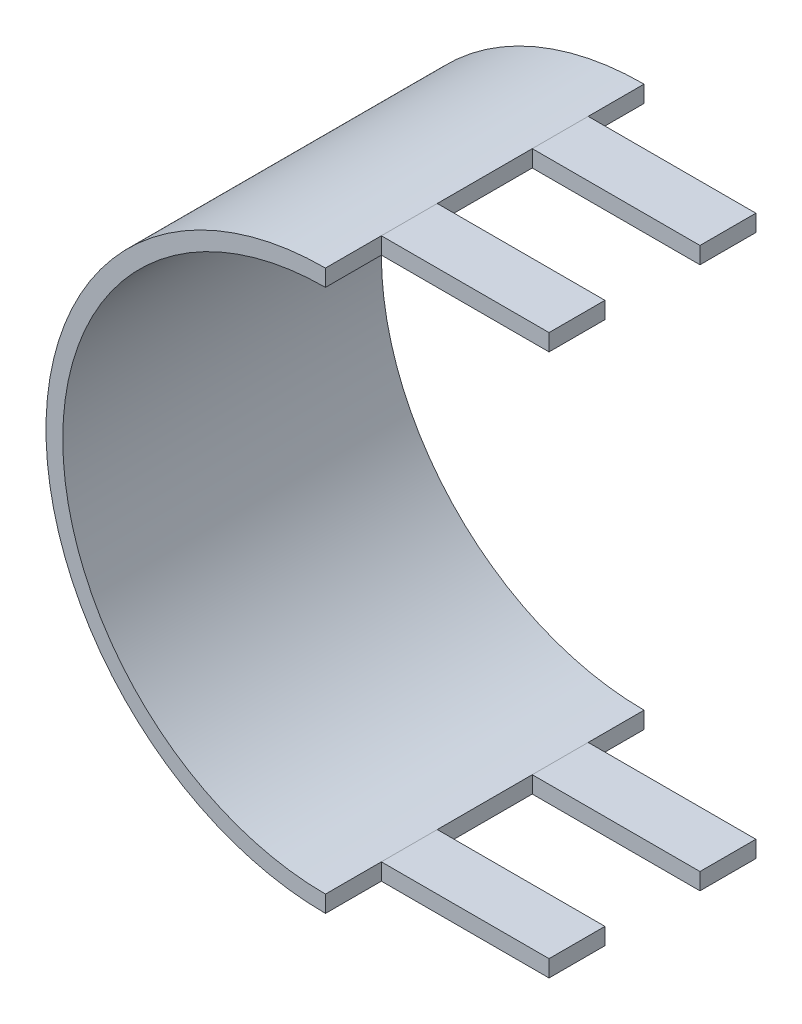
ISO-10303-21;
HEADER;
FILE_DESCRIPTION(('STEP AP214'),'2;1');
FILE_NAME('part.step','',(''),(''),'','','');
FILE_SCHEMA(('AUTOMOTIVE_DESIGN { 1 0 10303 214 1 1 1 1 }'));
ENDSEC;
DATA;
#1=APPLICATION_CONTEXT('core data for automotive mechanical design processes');
#2=APPLICATION_PROTOCOL_DEFINITION('international standard','automotive_design',2000,#1);
#3=PRODUCT_CONTEXT('',#1,'mechanical');
#4=PRODUCT('Part','Part','',(#3));
#5=PRODUCT_RELATED_PRODUCT_CATEGORY('part','',(#4));
#6=PRODUCT_DEFINITION_FORMATION('','',#4);
#7=PRODUCT_DEFINITION_CONTEXT('part definition',#1,'design');
#8=PRODUCT_DEFINITION('design','',#6,#7);
#9=PRODUCT_DEFINITION_SHAPE('','',#8);
#10=(LENGTH_UNIT() NAMED_UNIT(*) SI_UNIT(.MILLI.,.METRE.));
#11=(NAMED_UNIT(*) PLANE_ANGLE_UNIT() SI_UNIT($,.RADIAN.));
#12=(NAMED_UNIT(*) SI_UNIT($,.STERADIAN.) SOLID_ANGLE_UNIT());
#13=UNCERTAINTY_MEASURE_WITH_UNIT(LENGTH_MEASURE(1.E-05),#10,'distance_accuracy_value','');
#14=(GEOMETRIC_REPRESENTATION_CONTEXT(3) GLOBAL_UNCERTAINTY_ASSIGNED_CONTEXT((#13)) GLOBAL_UNIT_ASSIGNED_CONTEXT((#10,
#11,#12)) REPRESENTATION_CONTEXT('',''));
#15=CARTESIAN_POINT('',(0.,0.,0.));
#16=DIRECTION('',(0.,0.,1.));
#17=DIRECTION('',(1.,0.,0.));
#18=AXIS2_PLACEMENT_3D('',#15,#16,#17);
#19=CARTESIAN_POINT('',(-300.,-47.,3.));
#20=DIRECTION('',(0.,-1.,0.));
#21=DIRECTION('',(0.,0.,-1.));
#22=AXIS2_PLACEMENT_3D('',#19,#20,#21);
#23=PLANE('',#22);
#24=DIRECTION('',(-1.,0.,0.));
#25=VECTOR('',#24,1.);
#26=CARTESIAN_POINT('',(-300.,-47.,23.));
#27=LINE('',#26,#25);
#28=CARTESIAN_POINT('',(-270.,-47.,23.));
#29=VERTEX_POINT('',#28);
#30=CARTESIAN_POINT('',(-300.,-47.,23.));
#31=VERTEX_POINT('',#30);
#32=EDGE_CURVE('E205',#29,#31,#27,.T.);
#33=ORIENTED_EDGE('',*,*,#32,.F.);
#34=DIRECTION('',(0.,0.,1.));
#35=VECTOR('',#34,1.);
#36=CARTESIAN_POINT('',(-270.,-47.,3.));
#37=LINE('',#36,#35);
#38=CARTESIAN_POINT('',(-270.,-47.,13.));
#39=VERTEX_POINT('',#38);
#40=EDGE_CURVE('E177',#39,#29,#37,.T.);
#41=ORIENTED_EDGE('',*,*,#40,.F.);
#42=DIRECTION('',(1.,0.,0.));
#43=VECTOR('',#42,1.);
#44=CARTESIAN_POINT('',(-300.,-47.,13.));
#45=LINE('',#44,#43);
#46=CARTESIAN_POINT('',(-300.,-47.,13.));
#47=VERTEX_POINT('',#46);
#48=EDGE_CURVE('E208',#47,#39,#45,.T.);
#49=ORIENTED_EDGE('',*,*,#48,.F.);
#50=DIRECTION('',(0.,0.,1.));
#51=VECTOR('',#50,1.);
#52=CARTESIAN_POINT('',(-300.,-47.,3.));
#53=LINE('',#52,#51);
#54=EDGE_CURVE('E182',#47,#31,#53,.T.);
#55=ORIENTED_EDGE('',*,*,#54,.T.);
#56=EDGE_LOOP('',(#33,#41,#49,#55));
#57=FACE_BOUND('',#56,.T.);
#58=ADVANCED_FACE('F32',(#57),#23,.F.);
#59=CARTESIAN_POINT('',(-300.,-47.,3.));
#60=DIRECTION('',(0.,-1.,0.));
#61=DIRECTION('',(0.,0.,-1.));
#62=AXIS2_PLACEMENT_3D('',#59,#60,#61);
#63=PLANE('',#62);
#64=DIRECTION('',(-1.,0.,0.));
#65=VECTOR('',#64,1.);
#66=CARTESIAN_POINT('',(-300.,-47.,50.));
#67=LINE('',#66,#65);
#68=CARTESIAN_POINT('',(-270.,-47.,50.));
#69=VERTEX_POINT('',#68);
#70=CARTESIAN_POINT('',(-300.,-47.,50.));
#71=VERTEX_POINT('',#70);
#72=EDGE_CURVE('E278',#69,#71,#67,.T.);
#73=ORIENTED_EDGE('',*,*,#72,.F.);
#74=DIRECTION('',(0.,0.,1.));
#75=VECTOR('',#74,1.);
#76=CARTESIAN_POINT('',(-270.,-47.,3.));
#77=LINE('',#76,#75);
#78=CARTESIAN_POINT('',(-270.,-47.,40.));
#79=VERTEX_POINT('',#78);
#80=EDGE_CURVE('E280',#79,#69,#77,.T.);
#81=ORIENTED_EDGE('',*,*,#80,.F.);
#82=DIRECTION('',(1.,0.,0.));
#83=VECTOR('',#82,1.);
#84=CARTESIAN_POINT('',(-300.,-47.,40.));
#85=LINE('',#84,#83);
#86=CARTESIAN_POINT('',(-300.,-47.,40.));
#87=VERTEX_POINT('',#86);
#88=EDGE_CURVE('E251',#87,#79,#85,.T.);
#89=ORIENTED_EDGE('',*,*,#88,.F.);
#90=DIRECTION('',(0.,0.,1.));
#91=VECTOR('',#90,1.);
#92=CARTESIAN_POINT('',(-300.,-47.,3.));
#93=LINE('',#92,#91);
#94=EDGE_CURVE('E258',#87,#71,#93,.T.);
#95=ORIENTED_EDGE('',*,*,#94,.T.);
#96=EDGE_LOOP('',(#73,#81,#89,#95));
#97=FACE_BOUND('',#96,.T.);
#98=ADVANCED_FACE('F403',(#97),#63,.F.);
#99=CARTESIAN_POINT('',(300.,47.,3.));
#100=DIRECTION('',(0.,1.,0.));
#101=DIRECTION('',(0.,0.,1.));
#102=AXIS2_PLACEMENT_3D('',#99,#100,#101);
#103=PLANE('',#102);
#104=DIRECTION('',(1.,0.,0.));
#105=VECTOR('',#104,1.);
#106=CARTESIAN_POINT('',(300.,47.,50.));
#107=LINE('',#106,#105);
#108=CARTESIAN_POINT('',(-300.,47.,50.));
#109=VERTEX_POINT('',#108);
#110=CARTESIAN_POINT('',(-270.,47.,50.));
#111=VERTEX_POINT('',#110);
#112=EDGE_CURVE('E329',#109,#111,#107,.T.);
#113=ORIENTED_EDGE('',*,*,#112,.F.);
#114=DIRECTION('',(0.,0.,1.));
#115=VECTOR('',#114,1.);
#116=CARTESIAN_POINT('',(-300.,47.,3.));
#117=LINE('',#116,#115);
#118=CARTESIAN_POINT('',(-300.,47.,39.9999999999999));
#119=VERTEX_POINT('',#118);
#120=EDGE_CURVE('E321',#119,#109,#117,.T.);
#121=ORIENTED_EDGE('',*,*,#120,.F.);
#122=DIRECTION('',(-1.,0.,0.));
#123=VECTOR('',#122,1.);
#124=CARTESIAN_POINT('',(300.,47.,40.));
#125=LINE('',#124,#123);
#126=CARTESIAN_POINT('',(-270.,47.,40.));
#127=VERTEX_POINT('',#126);
#128=EDGE_CURVE('E334',#127,#119,#125,.T.);
#129=ORIENTED_EDGE('',*,*,#128,.F.);
#130=DIRECTION('',(0.,0.,-1.));
#131=VECTOR('',#130,1.);
#132=CARTESIAN_POINT('',(-270.,47.,3.));
#133=LINE('',#132,#131);
#134=EDGE_CURVE('E36',#111,#127,#133,.T.);
#135=ORIENTED_EDGE('',*,*,#134,.F.);
#136=EDGE_LOOP('',(#113,#121,#129,#135));
#137=FACE_BOUND('',#136,.T.);
#138=ADVANCED_FACE('F342',(#137),#103,.F.);
#139=CARTESIAN_POINT('',(300.,47.,3.));
#140=DIRECTION('',(0.,1.,0.));
#141=DIRECTION('',(0.,0.,1.));
#142=AXIS2_PLACEMENT_3D('',#139,#140,#141);
#143=PLANE('',#142);
#144=DIRECTION('',(1.,0.,0.));
#145=VECTOR('',#144,1.);
#146=CARTESIAN_POINT('',(300.,47.,22.9999999999999));
#147=LINE('',#146,#145);
#148=CARTESIAN_POINT('',(-300.,47.,23.));
#149=VERTEX_POINT('',#148);
#150=CARTESIAN_POINT('',(-270.,47.,23.));
#151=VERTEX_POINT('',#150);
#152=EDGE_CURVE('E307',#149,#151,#147,.T.);
#153=ORIENTED_EDGE('',*,*,#152,.F.);
#154=DIRECTION('',(0.,0.,1.));
#155=VECTOR('',#154,1.);
#156=CARTESIAN_POINT('',(-300.,47.,3.));
#157=LINE('',#156,#155);
#158=CARTESIAN_POINT('',(-300.,47.,13.));
#159=VERTEX_POINT('',#158);
#160=EDGE_CURVE('E289',#159,#149,#157,.T.);
#161=ORIENTED_EDGE('',*,*,#160,.F.);
#162=DIRECTION('',(-1.,0.,0.));
#163=VECTOR('',#162,1.);
#164=CARTESIAN_POINT('',(300.,47.,13.));
#165=LINE('',#164,#163);
#166=CARTESIAN_POINT('',(-270.,47.,13.));
#167=VERTEX_POINT('',#166);
#168=EDGE_CURVE('E301',#167,#159,#165,.T.);
#169=ORIENTED_EDGE('',*,*,#168,.F.);
#170=DIRECTION('',(0.,0.,-1.));
#171=VECTOR('',#170,1.);
#172=CARTESIAN_POINT('',(-270.,47.,3.));
#173=LINE('',#172,#171);
#174=EDGE_CURVE('E304',#151,#167,#173,.T.);
#175=ORIENTED_EDGE('',*,*,#174,.F.);
#176=EDGE_LOOP('',(#153,#161,#169,#175));
#177=FACE_BOUND('',#176,.T.);
#178=ADVANCED_FACE('F425',(#177),#143,.F.);
#179=CARTESIAN_POINT('',(-300.,46.99,13.));
#180=DIRECTION('',(0.,0.,-1.));
#181=DIRECTION('',(-1.,0.,0.));
#182=AXIS2_PLACEMENT_3D('',#179,#180,#181);
#183=PLANE('',#182);
#184=DIRECTION('',(0.,1.,0.));
#185=VECTOR('',#184,1.);
#186=CARTESIAN_POINT('',(-270.,46.99,13.));
#187=LINE('',#186,#185);
#188=CARTESIAN_POINT('',(-270.,50.,13.));
#189=VERTEX_POINT('',#188);
#190=EDGE_CURVE('E316',#167,#189,#187,.T.);
#191=ORIENTED_EDGE('',*,*,#190,.F.);
#192=ORIENTED_EDGE('',*,*,#168,.T.);
#193=DIRECTION('',(0.,-1.,0.));
#194=VECTOR('',#193,1.);
#195=CARTESIAN_POINT('',(-300.,0.,13.));
#196=LINE('',#195,#194);
#197=CARTESIAN_POINT('',(-300.,50.,13.));
#198=VERTEX_POINT('',#197);
#199=EDGE_CURVE('E292',#198,#159,#196,.T.);
#200=ORIENTED_EDGE('',*,*,#199,.F.);
#201=DIRECTION('',(1.,0.,0.));
#202=VECTOR('',#201,1.);
#203=CARTESIAN_POINT('',(-300.,50.,13.));
#204=LINE('',#203,#202);
#205=EDGE_CURVE('E255',#198,#189,#204,.T.);
#206=ORIENTED_EDGE('',*,*,#205,.T.);
#207=EDGE_LOOP('',(#191,#192,#200,#206));
#208=FACE_BOUND('',#207,.T.);
#209=ADVANCED_FACE('F413',(#208),#183,.T.);
#210=CARTESIAN_POINT('',(-300.,0.,0.));
#211=DIRECTION('',(-1.,0.,0.));
#212=DIRECTION('',(0.,0.,1.));
#213=AXIS2_PLACEMENT_3D('',#210,#211,#212);
#214=PLANE('',#213);
#215=DIRECTION('',(0.,0.,-1.));
#216=VECTOR('',#215,1.);
#217=CARTESIAN_POINT('',(-300.,50.,60.));
#218=LINE('',#217,#216);
#219=CARTESIAN_POINT('',(-300.,50.,3.));
#220=VERTEX_POINT('',#219);
#221=EDGE_CURVE('E235',#198,#220,#218,.T.);
#222=ORIENTED_EDGE('',*,*,#221,.F.);
#223=ORIENTED_EDGE('',*,*,#199,.T.);
#224=DIRECTION('',(0.,0.,1.));
#225=VECTOR('',#224,1.);
#226=CARTESIAN_POINT('',(-300.,47.,3.));
#227=LINE('',#226,#225);
#228=CARTESIAN_POINT('',(-300.,47.,3.));
#229=VERTEX_POINT('',#228);
#230=EDGE_CURVE('E220',#229,#159,#227,.T.);
#231=ORIENTED_EDGE('',*,*,#230,.F.);
#232=DIRECTION('',(0.,1.,0.));
#233=VECTOR('',#232,1.);
#234=CARTESIAN_POINT('',(-300.,0.,3.));
#235=LINE('',#234,#233);
#236=EDGE_CURVE('E248',#229,#220,#235,.T.);
#237=ORIENTED_EDGE('',*,*,#236,.T.);
#238=EDGE_LOOP('',(#222,#223,#231,#237));
#239=FACE_BOUND('',#238,.T.);
#240=ADVANCED_FACE('F410',(#239),#214,.F.);
#241=CARTESIAN_POINT('',(-270.,-50.01,40.));
#242=DIRECTION('',(1.,0.,0.));
#243=DIRECTION('',(0.,0.,-1.));
#244=AXIS2_PLACEMENT_3D('',#241,#242,#243);
#245=PLANE('',#244);
#246=DIRECTION('',(0.,1.,0.));
#247=VECTOR('',#246,1.);
#248=CARTESIAN_POINT('',(-270.,-50.01,50.));
#249=LINE('',#248,#247);
#250=CARTESIAN_POINT('',(-270.,-50.,50.));
#251=VERTEX_POINT('',#250);
#252=EDGE_CURVE('E256',#251,#69,#249,.T.);
#253=ORIENTED_EDGE('',*,*,#252,.F.);
#254=DIRECTION('',(0.,0.,-1.));
#255=VECTOR('',#254,1.);
#256=CARTESIAN_POINT('',(-270.,-50.,60.));
#257=LINE('',#256,#255);
#258=CARTESIAN_POINT('',(-270.,-50.,40.));
#259=VERTEX_POINT('',#258);
#260=EDGE_CURVE('E272',#251,#259,#257,.T.);
#261=ORIENTED_EDGE('',*,*,#260,.T.);
#262=DIRECTION('',(0.,1.,0.));
#263=VECTOR('',#262,1.);
#264=CARTESIAN_POINT('',(-270.,-50.01,40.));
#265=LINE('',#264,#263);
#266=EDGE_CURVE('E253',#259,#79,#265,.T.);
#267=ORIENTED_EDGE('',*,*,#266,.T.);
#268=ORIENTED_EDGE('',*,*,#80,.T.);
#269=EDGE_LOOP('',(#253,#261,#267,#268));
#270=FACE_BOUND('',#269,.T.);
#271=ADVANCED_FACE('F398',(#270),#245,.T.);
#272=CARTESIAN_POINT('',(-300.,-50.01,40.));
#273=DIRECTION('',(0.,0.,-1.));
#274=DIRECTION('',(-1.,0.,0.));
#275=AXIS2_PLACEMENT_3D('',#272,#273,#274);
#276=PLANE('',#275);
#277=ORIENTED_EDGE('',*,*,#266,.F.);
#278=DIRECTION('',(-1.,0.,0.));
#279=VECTOR('',#278,1.);
#280=CARTESIAN_POINT('',(-300.,-50.,40.));
#281=LINE('',#280,#279);
#282=CARTESIAN_POINT('',(-300.,-50.,40.));
#283=VERTEX_POINT('',#282);
#284=EDGE_CURVE('E275',#259,#283,#281,.T.);
#285=ORIENTED_EDGE('',*,*,#284,.T.);
#286=DIRECTION('',(0.,-1.,0.));
#287=VECTOR('',#286,1.);
#288=CARTESIAN_POINT('',(-300.,0.,40.));
#289=LINE('',#288,#287);
#290=EDGE_CURVE('E262',#87,#283,#289,.T.);
#291=ORIENTED_EDGE('',*,*,#290,.F.);
#292=ORIENTED_EDGE('',*,*,#88,.T.);
#293=EDGE_LOOP('',(#277,#285,#291,#292));
#294=FACE_BOUND('',#293,.T.);
#295=ADVANCED_FACE('F394',(#294),#276,.T.);
#296=CARTESIAN_POINT('',(-300.,-50.01,50.));
#297=DIRECTION('',(0.,0.,1.));
#298=DIRECTION('',(1.,0.,0.));
#299=AXIS2_PLACEMENT_3D('',#296,#297,#298);
#300=PLANE('',#299);
#301=DIRECTION('',(0.,1.,0.));
#302=VECTOR('',#301,1.);
#303=CARTESIAN_POINT('',(-300.,0.,50.));
#304=LINE('',#303,#302);
#305=CARTESIAN_POINT('',(-300.,-50.,50.));
#306=VERTEX_POINT('',#305);
#307=EDGE_CURVE('E259',#306,#71,#304,.T.);
#308=ORIENTED_EDGE('',*,*,#307,.F.);
#309=DIRECTION('',(1.,0.,0.));
#310=VECTOR('',#309,1.);
#311=CARTESIAN_POINT('',(-300.,-50.,50.));
#312=LINE('',#311,#310);
#313=EDGE_CURVE('E263',#306,#251,#312,.T.);
#314=ORIENTED_EDGE('',*,*,#313,.T.);
#315=ORIENTED_EDGE('',*,*,#252,.T.);
#316=ORIENTED_EDGE('',*,*,#72,.T.);
#317=EDGE_LOOP('',(#308,#314,#315,#316));
#318=FACE_BOUND('',#317,.T.);
#319=ADVANCED_FACE('F401',(#318),#300,.T.);
#320=CARTESIAN_POINT('',(0.,0.,3.));
#321=DIRECTION('',(0.,0.,1.));
#322=DIRECTION('',(1.,0.,0.));
#323=AXIS2_PLACEMENT_3D('',#320,#321,#322);
#324=PLANE('',#323);
#325=DIRECTION('',(0.,1.,0.));
#326=VECTOR('',#325,1.);
#327=CARTESIAN_POINT('',(-300.,0.,3.));
#328=LINE('',#327,#326);
#329=CARTESIAN_POINT('',(-300.,-50.,3.));
#330=VERTEX_POINT('',#329);
#331=CARTESIAN_POINT('',(-300.,-47.,3.));
#332=VERTEX_POINT('',#331);
#333=EDGE_CURVE('E245',#330,#332,#328,.T.);
#334=ORIENTED_EDGE('',*,*,#333,.F.);
#335=CARTESIAN_POINT('',(-300.,0.,3.));
#336=DIRECTION('',(0.,0.,1.));
#337=DIRECTION('',(1.,0.,0.));
#338=AXIS2_PLACEMENT_3D('',#335,#336,#337);
#339=CIRCLE('',#338,50.);
#340=EDGE_CURVE('E219',#220,#330,#339,.T.);
#341=ORIENTED_EDGE('',*,*,#340,.F.);
#342=ORIENTED_EDGE('',*,*,#236,.F.);
#343=CARTESIAN_POINT('',(-300.,0.,3.));
#344=DIRECTION('',(0.,0.,1.));
#345=DIRECTION('',(1.,0.,0.));
#346=AXIS2_PLACEMENT_3D('',#343,#344,#345);
#347=CIRCLE('',#346,47.);
#348=EDGE_CURVE('E244',#332,#229,#347,.F.);
#349=ORIENTED_EDGE('',*,*,#348,.F.);
#350=EDGE_LOOP('',(#334,#341,#342,#349));
#351=FACE_BOUND('',#350,.T.);
#352=ADVANCED_FACE('F407',(#351),#324,.F.);
#353=CARTESIAN_POINT('',(-270.,-50.01,13.));
#354=DIRECTION('',(1.,0.,0.));
#355=DIRECTION('',(0.,0.,-1.));
#356=AXIS2_PLACEMENT_3D('',#353,#354,#355);
#357=PLANE('',#356);
#358=DIRECTION('',(0.,1.,0.));
#359=VECTOR('',#358,1.);
#360=CARTESIAN_POINT('',(-270.,-50.01,23.));
#361=LINE('',#360,#359);
#362=CARTESIAN_POINT('',(-270.,-50.,23.));
#363=VERTEX_POINT('',#362);
#364=EDGE_CURVE('E172',#363,#29,#361,.T.);
#365=ORIENTED_EDGE('',*,*,#364,.F.);
#366=DIRECTION('',(0.,0.,-1.));
#367=VECTOR('',#366,1.);
#368=CARTESIAN_POINT('',(-270.,-50.,60.));
#369=LINE('',#368,#367);
#370=CARTESIAN_POINT('',(-270.,-50.,13.));
#371=VERTEX_POINT('',#370);
#372=EDGE_CURVE('E175',#363,#371,#369,.T.);
#373=ORIENTED_EDGE('',*,*,#372,.T.);
#374=DIRECTION('',(0.,1.,0.));
#375=VECTOR('',#374,1.);
#376=CARTESIAN_POINT('',(-270.,-50.01,13.));
#377=LINE('',#376,#375);
#378=EDGE_CURVE('E181',#371,#39,#377,.T.);
#379=ORIENTED_EDGE('',*,*,#378,.T.);
#380=ORIENTED_EDGE('',*,*,#40,.T.);
#381=EDGE_LOOP('',(#365,#373,#379,#380));
#382=FACE_BOUND('',#381,.T.);
#383=ADVANCED_FACE('F174',(#382),#357,.T.);
#384=CARTESIAN_POINT('',(-300.,-50.01,13.));
#385=DIRECTION('',(0.,0.,-1.));
#386=DIRECTION('',(-1.,0.,0.));
#387=AXIS2_PLACEMENT_3D('',#384,#385,#386);
#388=PLANE('',#387);
#389=ORIENTED_EDGE('',*,*,#378,.F.);
#390=DIRECTION('',(-1.,0.,0.));
#391=VECTOR('',#390,1.);
#392=CARTESIAN_POINT('',(-300.,-50.,13.));
#393=LINE('',#392,#391);
#394=CARTESIAN_POINT('',(-300.,-50.,13.));
#395=VERTEX_POINT('',#394);
#396=EDGE_CURVE('E191',#371,#395,#393,.T.);
#397=ORIENTED_EDGE('',*,*,#396,.T.);
#398=DIRECTION('',(0.,-1.,0.));
#399=VECTOR('',#398,1.);
#400=CARTESIAN_POINT('',(-300.,0.,13.));
#401=LINE('',#400,#399);
#402=EDGE_CURVE('E198',#47,#395,#401,.T.);
#403=ORIENTED_EDGE('',*,*,#402,.F.);
#404=ORIENTED_EDGE('',*,*,#48,.T.);
#405=EDGE_LOOP('',(#389,#397,#403,#404));
#406=FACE_BOUND('',#405,.T.);
#407=ADVANCED_FACE('F378',(#406),#388,.T.);
#408=CARTESIAN_POINT('',(-300.,-50.01,23.));
#409=DIRECTION('',(0.,0.,1.));
#410=DIRECTION('',(1.,0.,0.));
#411=AXIS2_PLACEMENT_3D('',#408,#409,#410);
#412=PLANE('',#411);
#413=DIRECTION('',(0.,1.,0.));
#414=VECTOR('',#413,1.);
#415=CARTESIAN_POINT('',(-300.,0.,23.));
#416=LINE('',#415,#414);
#417=CARTESIAN_POINT('',(-300.,-50.,23.));
#418=VERTEX_POINT('',#417);
#419=EDGE_CURVE('E196',#418,#31,#416,.T.);
#420=ORIENTED_EDGE('',*,*,#419,.F.);
#421=DIRECTION('',(1.,0.,0.));
#422=VECTOR('',#421,1.);
#423=CARTESIAN_POINT('',(-300.,-50.,23.));
#424=LINE('',#423,#422);
#425=EDGE_CURVE('E188',#418,#363,#424,.T.);
#426=ORIENTED_EDGE('',*,*,#425,.T.);
#427=ORIENTED_EDGE('',*,*,#364,.T.);
#428=ORIENTED_EDGE('',*,*,#32,.T.);
#429=EDGE_LOOP('',(#420,#426,#427,#428));
#430=FACE_BOUND('',#429,.T.);
#431=ADVANCED_FACE('F194',(#430),#412,.T.);
#432=CARTESIAN_POINT('',(-300.,-50.,60.));
#433=DIRECTION('',(0.,1.,0.));
#434=DIRECTION('',(0.,0.,1.));
#435=AXIS2_PLACEMENT_3D('',#432,#433,#434);
#436=PLANE('',#435);
#437=ORIENTED_EDGE('',*,*,#425,.F.);
#438=DIRECTION('',(0.,0.,-1.));
#439=VECTOR('',#438,1.);
#440=CARTESIAN_POINT('',(-300.,-50.,60.));
#441=LINE('',#440,#439);
#442=EDGE_CURVE('E201',#418,#395,#441,.T.);
#443=ORIENTED_EDGE('',*,*,#442,.T.);
#444=ORIENTED_EDGE('',*,*,#396,.F.);
#445=ORIENTED_EDGE('',*,*,#372,.F.);
#446=EDGE_LOOP('',(#437,#443,#444,#445));
#447=FACE_BOUND('',#446,.T.);
#448=ADVANCED_FACE('F187',(#447),#436,.F.);
#449=DIRECTION('',(0.,0.,1.));
#450=VECTOR('',#449,1.);
#451=CARTESIAN_POINT('',(-300.,-47.,3.));
#452=LINE('',#451,#450);
#453=EDGE_CURVE('E227',#332,#47,#452,.T.);
#454=ORIENTED_EDGE('',*,*,#453,.T.);
#455=ORIENTED_EDGE('',*,*,#402,.T.);
#456=DIRECTION('',(0.,0.,-1.));
#457=VECTOR('',#456,1.);
#458=CARTESIAN_POINT('',(-300.,-50.,60.));
#459=LINE('',#458,#457);
#460=EDGE_CURVE('E226',#395,#330,#459,.T.);
#461=ORIENTED_EDGE('',*,*,#460,.T.);
#462=ORIENTED_EDGE('',*,*,#333,.T.);
#463=EDGE_LOOP('',(#454,#455,#461,#462));
#464=FACE_BOUND('',#463,.T.);
#465=ADVANCED_FACE('F380',(#464),#214,.F.);
#466=CARTESIAN_POINT('',(-300.,-50.,60.));
#467=VERTEX_POINT('',#466);
#468=EDGE_CURVE('E221',#467,#306,#459,.T.);
#469=ORIENTED_EDGE('',*,*,#468,.T.);
#470=ORIENTED_EDGE('',*,*,#307,.T.);
#471=CARTESIAN_POINT('',(-300.,-47.,60.));
#472=VERTEX_POINT('',#471);
#473=EDGE_CURVE('E231',#71,#472,#452,.T.);
#474=ORIENTED_EDGE('',*,*,#473,.T.);
#475=DIRECTION('',(0.,-1.,0.));
#476=VECTOR('',#475,1.);
#477=CARTESIAN_POINT('',(-300.,0.,60.));
#478=LINE('',#477,#476);
#479=EDGE_CURVE('E224',#472,#467,#478,.T.);
#480=ORIENTED_EDGE('',*,*,#479,.T.);
#481=EDGE_LOOP('',(#469,#470,#474,#480));
#482=FACE_BOUND('',#481,.T.);
#483=ADVANCED_FACE('F364',(#482),#214,.F.);
#484=CARTESIAN_POINT('',(-300.,47.,60.));
#485=VERTEX_POINT('',#484);
#486=EDGE_CURVE('E214',#109,#485,#227,.T.);
#487=ORIENTED_EDGE('',*,*,#486,.F.);
#488=DIRECTION('',(0.,1.,0.));
#489=VECTOR('',#488,1.);
#490=CARTESIAN_POINT('',(-300.,0.,50.));
#491=LINE('',#490,#489);
#492=CARTESIAN_POINT('',(-300.,50.,50.));
#493=VERTEX_POINT('',#492);
#494=EDGE_CURVE('E327',#109,#493,#491,.T.);
#495=ORIENTED_EDGE('',*,*,#494,.T.);
#496=CARTESIAN_POINT('',(-300.,50.,60.));
#497=VERTEX_POINT('',#496);
#498=EDGE_CURVE('E215',#497,#493,#218,.T.);
#499=ORIENTED_EDGE('',*,*,#498,.F.);
#500=EDGE_CURVE('E232',#497,#485,#478,.T.);
#501=ORIENTED_EDGE('',*,*,#500,.T.);
#502=EDGE_LOOP('',(#487,#495,#499,#501));
#503=FACE_BOUND('',#502,.T.);
#504=ADVANCED_FACE('F357',(#503),#214,.F.);
#505=CARTESIAN_POINT('',(-300.,0.,60.));
#506=DIRECTION('',(0.,0.,1.));
#507=DIRECTION('',(1.,0.,0.));
#508=AXIS2_PLACEMENT_3D('',#505,#506,#507);
#509=PLANE('',#508);
#510=ORIENTED_EDGE('',*,*,#500,.F.);
#511=CARTESIAN_POINT('',(-300.,0.,60.));
#512=DIRECTION('',(0.,0.,1.));
#513=DIRECTION('',(1.,0.,0.));
#514=AXIS2_PLACEMENT_3D('',#511,#512,#513);
#515=CIRCLE('',#514,50.);
#516=EDGE_CURVE('E211',#497,#467,#515,.T.);
#517=ORIENTED_EDGE('',*,*,#516,.T.);
#518=ORIENTED_EDGE('',*,*,#479,.F.);
#519=CARTESIAN_POINT('',(-300.,0.,60.));
#520=DIRECTION('',(0.,0.,1.));
#521=DIRECTION('',(1.,0.,0.));
#522=AXIS2_PLACEMENT_3D('',#519,#520,#521);
#523=CIRCLE('',#522,47.);
#524=EDGE_CURVE('E216',#485,#472,#523,.T.);
#525=ORIENTED_EDGE('',*,*,#524,.F.);
#526=EDGE_LOOP('',(#510,#517,#518,#525));
#527=FACE_BOUND('',#526,.T.);
#528=ADVANCED_FACE('F361',(#527),#509,.T.);
#529=CARTESIAN_POINT('',(-300.,-50.,60.));
#530=DIRECTION('',(0.,1.,0.));
#531=DIRECTION('',(0.,0.,1.));
#532=AXIS2_PLACEMENT_3D('',#529,#530,#531);
#533=PLANE('',#532);
#534=ORIENTED_EDGE('',*,*,#313,.F.);
#535=DIRECTION('',(0.,0.,-1.));
#536=VECTOR('',#535,1.);
#537=CARTESIAN_POINT('',(-300.,-50.,60.));
#538=LINE('',#537,#536);
#539=EDGE_CURVE('E266',#306,#283,#538,.T.);
#540=ORIENTED_EDGE('',*,*,#539,.T.);
#541=ORIENTED_EDGE('',*,*,#284,.F.);
#542=ORIENTED_EDGE('',*,*,#260,.F.);
#543=EDGE_LOOP('',(#534,#540,#541,#542));
#544=FACE_BOUND('',#543,.T.);
#545=ADVANCED_FACE('F391',(#544),#533,.F.);
#546=EDGE_CURVE('E230',#31,#87,#452,.T.);
#547=ORIENTED_EDGE('',*,*,#546,.T.);
#548=ORIENTED_EDGE('',*,*,#290,.T.);
#549=EDGE_CURVE('E225',#283,#418,#459,.T.);
#550=ORIENTED_EDGE('',*,*,#549,.T.);
#551=ORIENTED_EDGE('',*,*,#419,.T.);
#552=EDGE_LOOP('',(#547,#548,#550,#551));
#553=FACE_BOUND('',#552,.T.);
#554=ADVANCED_FACE('F385',(#553),#214,.F.);
#555=CARTESIAN_POINT('',(-270.,46.99,13.));
#556=DIRECTION('',(1.,0.,0.));
#557=DIRECTION('',(0.,0.,-1.));
#558=AXIS2_PLACEMENT_3D('',#555,#556,#557);
#559=PLANE('',#558);
#560=DIRECTION('',(0.,1.,0.));
#561=VECTOR('',#560,1.);
#562=CARTESIAN_POINT('',(-270.,46.99,23.));
#563=LINE('',#562,#561);
#564=CARTESIAN_POINT('',(-270.,50.,23.));
#565=VERTEX_POINT('',#564);
#566=EDGE_CURVE('E288',#151,#565,#563,.T.);
#567=ORIENTED_EDGE('',*,*,#566,.F.);
#568=ORIENTED_EDGE('',*,*,#174,.T.);
#569=ORIENTED_EDGE('',*,*,#190,.T.);
#570=DIRECTION('',(0.,0.,1.));
#571=VECTOR('',#570,1.);
#572=CARTESIAN_POINT('',(-270.,50.,60.));
#573=LINE('',#572,#571);
#574=EDGE_CURVE('E295',#189,#565,#573,.T.);
#575=ORIENTED_EDGE('',*,*,#574,.T.);
#576=EDGE_LOOP('',(#567,#568,#569,#575));
#577=FACE_BOUND('',#576,.T.);
#578=ADVANCED_FACE('F421',(#577),#559,.T.);
#579=CARTESIAN_POINT('',(-300.,46.99,23.));
#580=DIRECTION('',(0.,0.,1.));
#581=DIRECTION('',(1.,0.,0.));
#582=AXIS2_PLACEMENT_3D('',#579,#580,#581);
#583=PLANE('',#582);
#584=DIRECTION('',(0.,1.,0.));
#585=VECTOR('',#584,1.);
#586=CARTESIAN_POINT('',(-300.,0.,23.));
#587=LINE('',#586,#585);
#588=CARTESIAN_POINT('',(-300.,50.,23.));
#589=VERTEX_POINT('',#588);
#590=EDGE_CURVE('E310',#149,#589,#587,.T.);
#591=ORIENTED_EDGE('',*,*,#590,.F.);
#592=ORIENTED_EDGE('',*,*,#152,.T.);
#593=ORIENTED_EDGE('',*,*,#566,.T.);
#594=DIRECTION('',(-1.,0.,0.));
#595=VECTOR('',#594,1.);
#596=CARTESIAN_POINT('',(-300.,50.,23.));
#597=LINE('',#596,#595);
#598=EDGE_CURVE('E298',#565,#589,#597,.T.);
#599=ORIENTED_EDGE('',*,*,#598,.T.);
#600=EDGE_LOOP('',(#591,#592,#593,#599));
#601=FACE_BOUND('',#600,.T.);
#602=ADVANCED_FACE('F427',(#601),#583,.T.);
#603=CARTESIAN_POINT('',(-300.,50.,60.));
#604=DIRECTION('',(0.,-1.,0.));
#605=DIRECTION('',(0.,0.,-1.));
#606=AXIS2_PLACEMENT_3D('',#603,#604,#605);
#607=PLANE('',#606);
#608=ORIENTED_EDGE('',*,*,#598,.F.);
#609=ORIENTED_EDGE('',*,*,#574,.F.);
#610=ORIENTED_EDGE('',*,*,#205,.F.);
#611=DIRECTION('',(0.,0.,-1.));
#612=VECTOR('',#611,1.);
#613=CARTESIAN_POINT('',(-300.,50.,60.));
#614=LINE('',#613,#612);
#615=EDGE_CURVE('E285',#589,#198,#614,.T.);
#616=ORIENTED_EDGE('',*,*,#615,.F.);
#617=EDGE_LOOP('',(#608,#609,#610,#616));
#618=FACE_BOUND('',#617,.T.);
#619=ADVANCED_FACE('F419',(#618),#607,.F.);
#620=CARTESIAN_POINT('',(-300.,46.99,40.));
#621=DIRECTION('',(0.,0.,-1.));
#622=DIRECTION('',(-1.,0.,0.));
#623=AXIS2_PLACEMENT_3D('',#620,#621,#622);
#624=PLANE('',#623);
#625=DIRECTION('',(0.,1.,0.));
#626=VECTOR('',#625,1.);
#627=CARTESIAN_POINT('',(-270.,46.99,40.));
#628=LINE('',#627,#626);
#629=CARTESIAN_POINT('',(-270.,50.,40.));
#630=VERTEX_POINT('',#629);
#631=EDGE_CURVE('E56',#127,#630,#628,.T.);
#632=ORIENTED_EDGE('',*,*,#631,.F.);
#633=ORIENTED_EDGE('',*,*,#128,.T.);
#634=DIRECTION('',(0.,-1.,0.));
#635=VECTOR('',#634,1.);
#636=CARTESIAN_POINT('',(-300.,0.,40.));
#637=LINE('',#636,#635);
#638=CARTESIAN_POINT('',(-300.,50.,40.));
#639=VERTEX_POINT('',#638);
#640=EDGE_CURVE('E324',#639,#119,#637,.T.);
#641=ORIENTED_EDGE('',*,*,#640,.F.);
#642=DIRECTION('',(1.,0.,0.));
#643=VECTOR('',#642,1.);
#644=CARTESIAN_POINT('',(-300.,50.,40.));
#645=LINE('',#644,#643);
#646=EDGE_CURVE('E11',#639,#630,#645,.T.);
#647=ORIENTED_EDGE('',*,*,#646,.T.);
#648=EDGE_LOOP('',(#632,#633,#641,#647));
#649=FACE_BOUND('',#648,.T.);
#650=ADVANCED_FACE('F344',(#649),#624,.T.);
#651=EDGE_CURVE('E238',#639,#589,#218,.T.);
#652=ORIENTED_EDGE('',*,*,#651,.F.);
#653=ORIENTED_EDGE('',*,*,#640,.T.);
#654=EDGE_CURVE('E241',#149,#119,#227,.T.);
#655=ORIENTED_EDGE('',*,*,#654,.F.);
#656=ORIENTED_EDGE('',*,*,#590,.T.);
#657=EDGE_LOOP('',(#652,#653,#655,#656));
#658=FACE_BOUND('',#657,.T.);
#659=ADVANCED_FACE('F350',(#658),#214,.F.);
#660=CARTESIAN_POINT('',(-270.,46.99,40.));
#661=DIRECTION('',(1.,0.,0.));
#662=DIRECTION('',(0.,0.,-1.));
#663=AXIS2_PLACEMENT_3D('',#660,#661,#662);
#664=PLANE('',#663);
#665=DIRECTION('',(0.,1.,0.));
#666=VECTOR('',#665,1.);
#667=CARTESIAN_POINT('',(-270.,46.99,50.));
#668=LINE('',#667,#666);
#669=CARTESIAN_POINT('',(-270.,50.,50.));
#670=VERTEX_POINT('',#669);
#671=EDGE_CURVE('E49',#111,#670,#668,.T.);
#672=ORIENTED_EDGE('',*,*,#671,.F.);
#673=ORIENTED_EDGE('',*,*,#134,.T.);
#674=ORIENTED_EDGE('',*,*,#631,.T.);
#675=DIRECTION('',(0.,0.,1.));
#676=VECTOR('',#675,1.);
#677=CARTESIAN_POINT('',(-270.,50.,60.));
#678=LINE('',#677,#676);
#679=EDGE_CURVE('E41',#630,#670,#678,.T.);
#680=ORIENTED_EDGE('',*,*,#679,.T.);
#681=EDGE_LOOP('',(#672,#673,#674,#680));
#682=FACE_BOUND('',#681,.T.);
#683=ADVANCED_FACE('F340',(#682),#664,.T.);
#684=CARTESIAN_POINT('',(-300.,46.99,50.));
#685=DIRECTION('',(0.,0.,1.));
#686=DIRECTION('',(1.,0.,0.));
#687=AXIS2_PLACEMENT_3D('',#684,#685,#686);
#688=PLANE('',#687);
#689=ORIENTED_EDGE('',*,*,#494,.F.);
#690=ORIENTED_EDGE('',*,*,#112,.T.);
#691=ORIENTED_EDGE('',*,*,#671,.T.);
#692=DIRECTION('',(-1.,0.,0.));
#693=VECTOR('',#692,1.);
#694=CARTESIAN_POINT('',(-300.,50.,50.));
#695=LINE('',#694,#693);
#696=EDGE_CURVE('E332',#670,#493,#695,.T.);
#697=ORIENTED_EDGE('',*,*,#696,.T.);
#698=EDGE_LOOP('',(#689,#690,#691,#697));
#699=FACE_BOUND('',#698,.T.);
#700=ADVANCED_FACE('F438',(#699),#688,.T.);
#701=CARTESIAN_POINT('',(-300.,50.,60.));
#702=DIRECTION('',(0.,-1.,0.));
#703=DIRECTION('',(0.,0.,-1.));
#704=AXIS2_PLACEMENT_3D('',#701,#702,#703);
#705=PLANE('',#704);
#706=ORIENTED_EDGE('',*,*,#696,.F.);
#707=ORIENTED_EDGE('',*,*,#679,.F.);
#708=ORIENTED_EDGE('',*,*,#646,.F.);
#709=DIRECTION('',(0.,0.,-1.));
#710=VECTOR('',#709,1.);
#711=CARTESIAN_POINT('',(-300.,50.,60.));
#712=LINE('',#711,#710);
#713=EDGE_CURVE('E318',#493,#639,#712,.T.);
#714=ORIENTED_EDGE('',*,*,#713,.F.);
#715=EDGE_LOOP('',(#706,#707,#708,#714));
#716=FACE_BOUND('',#715,.T.);
#717=ADVANCED_FACE('F436',(#716),#705,.F.);
#718=CARTESIAN_POINT('',(-300.,0.,60.));
#719=DIRECTION('',(0.,0.,-1.));
#720=DIRECTION('',(-1.,0.,0.));
#721=AXIS2_PLACEMENT_3D('',#718,#719,#720);
#722=CYLINDRICAL_SURFACE('',#721,50.);
#723=ORIENTED_EDGE('',*,*,#498,.T.);
#724=ORIENTED_EDGE('',*,*,#713,.T.);
#725=ORIENTED_EDGE('',*,*,#651,.T.);
#726=ORIENTED_EDGE('',*,*,#615,.T.);
#727=ORIENTED_EDGE('',*,*,#221,.T.);
#728=ORIENTED_EDGE('',*,*,#340,.T.);
#729=ORIENTED_EDGE('',*,*,#460,.F.);
#730=ORIENTED_EDGE('',*,*,#442,.F.);
#731=ORIENTED_EDGE('',*,*,#549,.F.);
#732=ORIENTED_EDGE('',*,*,#539,.F.);
#733=ORIENTED_EDGE('',*,*,#468,.F.);
#734=ORIENTED_EDGE('',*,*,#516,.F.);
#735=EDGE_LOOP('',(#723,#724,#725,#726,#727,#728,#729,#730,#731,#732,#733,#734));
#736=FACE_BOUND('',#735,.T.);
#737=ADVANCED_FACE('F381',(#736),#722,.T.);
#738=CARTESIAN_POINT('',(-300.,0.,3.));
#739=DIRECTION('',(0.,0.,1.));
#740=DIRECTION('',(1.,0.,0.));
#741=AXIS2_PLACEMENT_3D('',#738,#739,#740);
#742=CYLINDRICAL_SURFACE('',#741,47.);
#743=ORIENTED_EDGE('',*,*,#453,.F.);
#744=ORIENTED_EDGE('',*,*,#348,.T.);
#745=ORIENTED_EDGE('',*,*,#230,.T.);
#746=ORIENTED_EDGE('',*,*,#160,.T.);
#747=ORIENTED_EDGE('',*,*,#654,.T.);
#748=ORIENTED_EDGE('',*,*,#120,.T.);
#749=ORIENTED_EDGE('',*,*,#486,.T.);
#750=ORIENTED_EDGE('',*,*,#524,.T.);
#751=ORIENTED_EDGE('',*,*,#473,.F.);
#752=ORIENTED_EDGE('',*,*,#94,.F.);
#753=ORIENTED_EDGE('',*,*,#546,.F.);
#754=ORIENTED_EDGE('',*,*,#54,.F.);
#755=EDGE_LOOP('',(#743,#744,#745,#746,#747,#748,#749,#750,#751,#752,#753,#754));
#756=FACE_BOUND('',#755,.T.);
#757=ADVANCED_FACE('F34',(#756),#742,.F.);
#758=CLOSED_SHELL('',(#58,#98,#138,#178,#209,#240,#271,#295,#319,#352,#383,#407,#431,#448,#465,
#483,#504,#528,#545,#554,#578,#602,#619,#650,#659,#683,#700,#717,#737,#757));
#759=MANIFOLD_SOLID_BREP('B2',#758);
#760=ADVANCED_BREP_SHAPE_REPRESENTATION('',(#18,#759),#14);
#761=SHAPE_DEFINITION_REPRESENTATION(#9,#760);
ENDSEC;
END-ISO-10303-21;
